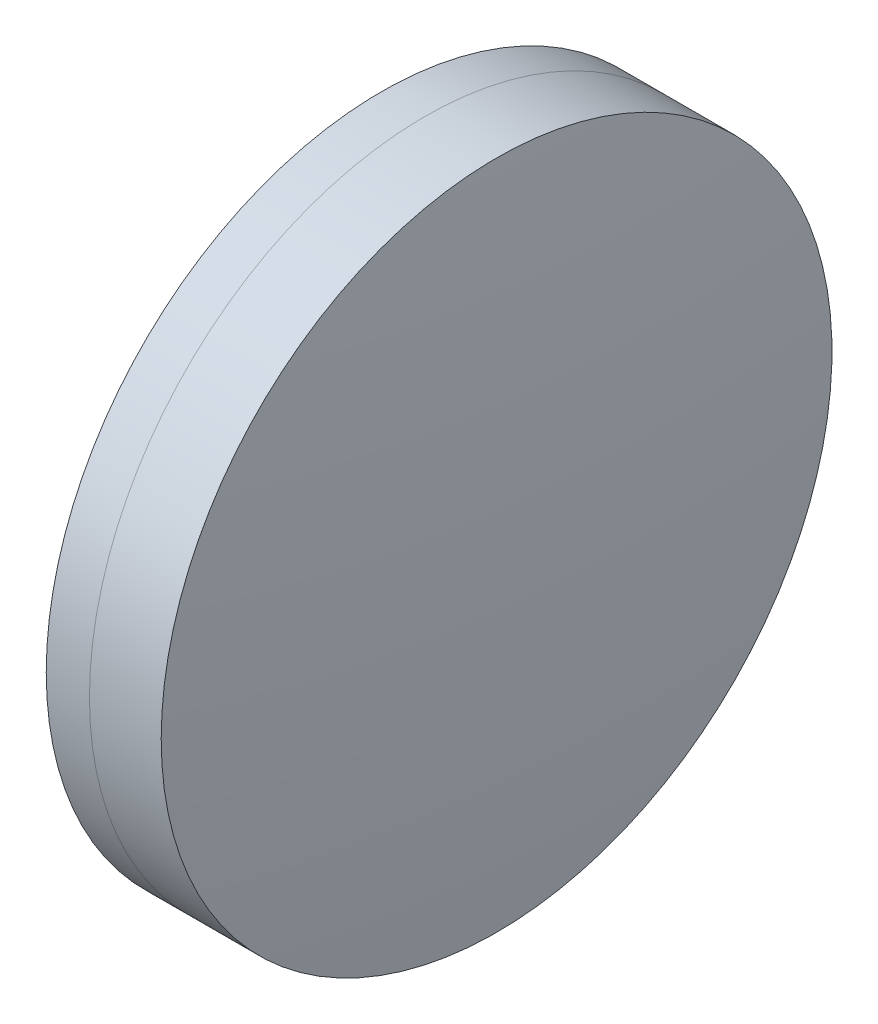
ISO-10303-21;
HEADER;
FILE_DESCRIPTION(('STEP AP214'),'2;1');
FILE_NAME('part.step','',(''),(''),'','','');
FILE_SCHEMA(('AUTOMOTIVE_DESIGN { 1 0 10303 214 1 1 1 1 }'));
ENDSEC;
DATA;
#1=APPLICATION_CONTEXT('core data for automotive mechanical design processes');
#2=APPLICATION_PROTOCOL_DEFINITION('international standard','automotive_design',2000,#1);
#3=PRODUCT_CONTEXT('',#1,'mechanical');
#4=PRODUCT('Part','Part','',(#3));
#5=PRODUCT_RELATED_PRODUCT_CATEGORY('part','',(#4));
#6=PRODUCT_DEFINITION_FORMATION('','',#4);
#7=PRODUCT_DEFINITION_CONTEXT('part definition',#1,'design');
#8=PRODUCT_DEFINITION('design','',#6,#7);
#9=PRODUCT_DEFINITION_SHAPE('','',#8);
#10=(LENGTH_UNIT() NAMED_UNIT(*) SI_UNIT(.MILLI.,.METRE.));
#11=(NAMED_UNIT(*) PLANE_ANGLE_UNIT() SI_UNIT($,.RADIAN.));
#12=(NAMED_UNIT(*) SI_UNIT($,.STERADIAN.) SOLID_ANGLE_UNIT());
#13=UNCERTAINTY_MEASURE_WITH_UNIT(LENGTH_MEASURE(1.E-05),#10,'distance_accuracy_value','');
#14=(GEOMETRIC_REPRESENTATION_CONTEXT(3) GLOBAL_UNCERTAINTY_ASSIGNED_CONTEXT((#13)) GLOBAL_UNIT_ASSIGNED_CONTEXT((#10,
#11,#12)) REPRESENTATION_CONTEXT('',''));
#15=CARTESIAN_POINT('',(0.,0.,0.));
#16=DIRECTION('',(0.,0.,1.));
#17=DIRECTION('',(1.,0.,0.));
#18=AXIS2_PLACEMENT_3D('',#15,#16,#17);
#19=CARTESIAN_POINT('',(216.122625551225,0.,0.));
#20=DIRECTION('',(-1.,0.,0.));
#21=DIRECTION('',(0.,0.,1.));
#22=AXIS2_PLACEMENT_3D('',#19,#20,#21);
#23=SPHERICAL_SURFACE('',#22,94.585);
#24=CARTESIAN_POINT('',(305.82391999562,0.,0.));
#25=DIRECTION('',(-1.,0.,0.));
#26=DIRECTION('',(0.,0.,1.));
#27=AXIS2_PLACEMENT_3D('',#24,#25,#26);
#28=CIRCLE('',#27,30.);
#29=CARTESIAN_POINT('',(305.82391999562,0.,30.));
#30=VERTEX_POINT('',#29);
#31=EDGE_CURVE('E11',#30,#30,#28,.T.);
#32=ORIENTED_EDGE('',*,*,#31,.T.);
#33=EDGE_LOOP('',(#32));
#34=FACE_BOUND('',#33,.T.);
#35=ADVANCED_FACE('F45',(#34),#23,.F.);
#36=CARTESIAN_POINT('',(-0.551919992657797,0.,0.));
#37=DIRECTION('',(-1.,0.,0.));
#38=DIRECTION('',(0.,0.,1.));
#39=AXIS2_PLACEMENT_3D('',#36,#37,#38);
#40=CYLINDRICAL_SURFACE('',#39,30.);
#41=CARTESIAN_POINT('',(312.241892944165,0.,0.));
#42=DIRECTION('',(-1.,0.,0.));
#43=DIRECTION('',(0.,0.,1.));
#44=AXIS2_PLACEMENT_3D('',#41,#42,#43);
#45=CIRCLE('',#44,30.);
#46=CARTESIAN_POINT('',(312.241892944165,0.,30.));
#47=VERTEX_POINT('',#46);
#48=EDGE_CURVE('E51',#47,#47,#45,.T.);
#49=ORIENTED_EDGE('',*,*,#48,.T.);
#50=EDGE_LOOP('',(#49));
#51=FACE_BOUND('',#50,.T.);
#52=ORIENTED_EDGE('',*,*,#31,.F.);
#53=EDGE_LOOP('',(#52));
#54=FACE_BOUND('',#53,.T.);
#55=ADVANCED_FACE('F57',(#51,#54),#40,.T.);
#56=CARTESIAN_POINT('',(31.0376255512255,0.,0.));
#57=DIRECTION('',(-1.,0.,0.));
#58=DIRECTION('',(0.,0.,1.));
#59=AXIS2_PLACEMENT_3D('',#56,#57,#58);
#60=SPHERICAL_SURFACE('',#59,282.8);
#61=ORIENTED_EDGE('',*,*,#48,.F.);
#62=EDGE_LOOP('',(#61));
#63=FACE_BOUND('',#62,.T.);
#64=ADVANCED_FACE('F60',(#63),#60,.T.);
#65=CLOSED_SHELL('',(#35,#55,#64));
#66=MANIFOLD_SOLID_BREP('B2',#65);
#67=CARTESIAN_POINT('',(425.500625551225,0.,0.));
#68=DIRECTION('',(-1.,0.,0.));
#69=DIRECTION('',(0.,0.,-1.));
#70=AXIS2_PLACEMENT_3D('',#67,#68,#69);
#71=SPHERICAL_SURFACE('',#70,127.133);
#72=CARTESIAN_POINT('',(301.95792164282,0.,0.));
#73=DIRECTION('',(-1.,0.,0.));
#74=DIRECTION('',(0.,0.,1.));
#75=AXIS2_PLACEMENT_3D('',#72,#73,#74);
#76=CIRCLE('',#75,30.);
#77=CARTESIAN_POINT('',(301.95792164282,0.,30.));
#78=VERTEX_POINT('',#77);
#79=EDGE_CURVE('E44',#78,#78,#76,.T.);
#80=ORIENTED_EDGE('',*,*,#79,.T.);
#81=EDGE_LOOP('',(#80));
#82=FACE_BOUND('',#81,.T.);
#83=ADVANCED_FACE('F86',(#82),#71,.T.);
#84=CARTESIAN_POINT('',(124.523309526045,0.,0.));
#85=DIRECTION('',(-1.,0.,0.));
#86=DIRECTION('',(0.,0.,1.));
#87=AXIS2_PLACEMENT_3D('',#84,#85,#86);
#88=CYLINDRICAL_SURFACE('',#87,30.);
#89=CARTESIAN_POINT('',(305.82391999562,0.,0.));
#90=DIRECTION('',(-1.,0.,0.));
#91=DIRECTION('',(0.,0.,1.));
#92=AXIS2_PLACEMENT_3D('',#89,#90,#91);
#93=CIRCLE('',#92,30.);
#94=CARTESIAN_POINT('',(305.82391999562,0.,30.));
#95=VERTEX_POINT('',#94);
#96=EDGE_CURVE('E92',#95,#95,#93,.T.);
#97=ORIENTED_EDGE('',*,*,#96,.T.);
#98=EDGE_LOOP('',(#97));
#99=FACE_BOUND('',#98,.T.);
#100=ORIENTED_EDGE('',*,*,#79,.F.);
#101=EDGE_LOOP('',(#100));
#102=FACE_BOUND('',#101,.T.);
#103=ADVANCED_FACE('F98',(#99,#102),#88,.T.);
#104=CARTESIAN_POINT('',(216.122625551225,0.,0.));
#105=DIRECTION('',(-1.,0.,0.));
#106=DIRECTION('',(0.,0.,1.));
#107=AXIS2_PLACEMENT_3D('',#104,#105,#106);
#108=SPHERICAL_SURFACE('',#107,94.585);
#109=ORIENTED_EDGE('',*,*,#96,.F.);
#110=EDGE_LOOP('',(#109));
#111=FACE_BOUND('',#110,.T.);
#112=ADVANCED_FACE('F101',(#111),#108,.T.);
#113=CLOSED_SHELL('',(#83,#103,#112));
#114=MANIFOLD_SOLID_BREP('B6',#113);
#115=ADVANCED_BREP_SHAPE_REPRESENTATION('',(#18,#66,#114),#14);
#116=SHAPE_DEFINITION_REPRESENTATION(#9,#115);
ENDSEC;
END-ISO-10303-21;
